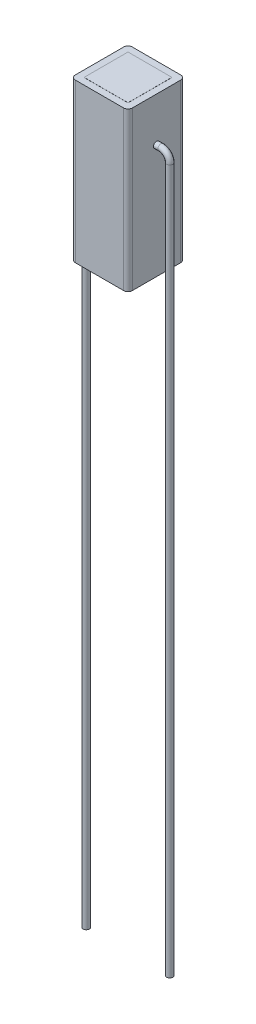
ISO-10303-21;
HEADER;
FILE_DESCRIPTION(('STEP AP214'),'2;1');
FILE_NAME('part.step','',(''),(''),'','','');
FILE_SCHEMA(('AUTOMOTIVE_DESIGN { 1 0 10303 214 1 1 1 1 }'));
ENDSEC;
DATA;
#1=APPLICATION_CONTEXT('core data for automotive mechanical design processes');
#2=APPLICATION_PROTOCOL_DEFINITION('international standard','automotive_design',2000,#1);
#3=PRODUCT_CONTEXT('',#1,'mechanical');
#4=PRODUCT('Part','Part','',(#3));
#5=PRODUCT_RELATED_PRODUCT_CATEGORY('part','',(#4));
#6=PRODUCT_DEFINITION_FORMATION('','',#4);
#7=PRODUCT_DEFINITION_CONTEXT('part definition',#1,'design');
#8=PRODUCT_DEFINITION('design','',#6,#7);
#9=PRODUCT_DEFINITION_SHAPE('','',#8);
#10=(LENGTH_UNIT() NAMED_UNIT(*) SI_UNIT(.MILLI.,.METRE.));
#11=(NAMED_UNIT(*) PLANE_ANGLE_UNIT() SI_UNIT($,.RADIAN.));
#12=(NAMED_UNIT(*) SI_UNIT($,.STERADIAN.) SOLID_ANGLE_UNIT());
#13=UNCERTAINTY_MEASURE_WITH_UNIT(LENGTH_MEASURE(1.E-05),#10,'distance_accuracy_value','');
#14=(GEOMETRIC_REPRESENTATION_CONTEXT(3) GLOBAL_UNCERTAINTY_ASSIGNED_CONTEXT((#13)) GLOBAL_UNIT_ASSIGNED_CONTEXT((#10,
#11,#12)) REPRESENTATION_CONTEXT('',''));
#15=CARTESIAN_POINT('',(0.,0.,0.));
#16=DIRECTION('',(0.,0.,1.));
#17=DIRECTION('',(1.,0.,0.));
#18=AXIS2_PLACEMENT_3D('',#15,#16,#17);
#19=CARTESIAN_POINT('',(3.25000000000001,18.,-3.25));
#20=DIRECTION('',(-1.,0.,0.));
#21=DIRECTION('',(0.,0.,1.));
#22=AXIS2_PLACEMENT_3D('',#19,#20,#21);
#23=PLANE('',#22);
#24=CARTESIAN_POINT('',(3.25000000000001,13.,0.));
#25=DIRECTION('',(-1.,0.,0.));
#26=DIRECTION('',(0.,0.,1.));
#27=AXIS2_PLACEMENT_3D('',#24,#25,#26);
#28=CIRCLE('',#27,0.35);
#29=CARTESIAN_POINT('',(3.25000000000001,13.,0.35));
#30=VERTEX_POINT('',#29);
#31=EDGE_CURVE('E293',#30,#30,#28,.F.);
#32=ORIENTED_EDGE('',*,*,#31,.F.);
#33=EDGE_LOOP('',(#32));
#34=FACE_BOUND('',#33,.T.);
#35=DIRECTION('',(0.,0.,-1.));
#36=VECTOR('',#35,1.);
#37=CARTESIAN_POINT('',(3.25000000000001,18.,-3.25));
#38=LINE('',#37,#36);
#39=CARTESIAN_POINT('',(3.25000000000001,18.,2.75000000000001));
#40=VERTEX_POINT('',#39);
#41=CARTESIAN_POINT('',(3.25000000000001,18.,-2.75));
#42=VERTEX_POINT('',#41);
#43=EDGE_CURVE('E261',#40,#42,#38,.T.);
#44=ORIENTED_EDGE('',*,*,#43,.F.);
#45=DIRECTION('',(0.,-1.,0.));
#46=VECTOR('',#45,1.);
#47=CARTESIAN_POINT('',(3.25000000000001,18.,2.75000000000001));
#48=LINE('',#47,#46);
#49=CARTESIAN_POINT('',(3.25000000000001,0.,2.75000000000001));
#50=VERTEX_POINT('',#49);
#51=EDGE_CURVE('E301',#40,#50,#48,.T.);
#52=ORIENTED_EDGE('',*,*,#51,.T.);
#53=DIRECTION('',(0.,0.,-1.));
#54=VECTOR('',#53,1.);
#55=CARTESIAN_POINT('',(3.25000000000001,0.,-3.25));
#56=LINE('',#55,#54);
#57=CARTESIAN_POINT('',(3.25000000000001,0.,-2.75));
#58=VERTEX_POINT('',#57);
#59=EDGE_CURVE('E260',#50,#58,#56,.T.);
#60=ORIENTED_EDGE('',*,*,#59,.T.);
#61=DIRECTION('',(0.,-1.,0.));
#62=VECTOR('',#61,1.);
#63=CARTESIAN_POINT('',(3.25000000000001,18.,-2.75));
#64=LINE('',#63,#62);
#65=EDGE_CURVE('E299',#58,#42,#64,.F.);
#66=ORIENTED_EDGE('',*,*,#65,.T.);
#67=EDGE_LOOP('',(#44,#52,#60,#66));
#68=FACE_BOUND('',#67,.T.);
#69=ADVANCED_FACE('F71',(#34,#68),#23,.F.);
#70=CARTESIAN_POINT('',(-3.24999999999999,18.,-3.25));
#71=DIRECTION('',(0.,0.,1.));
#72=DIRECTION('',(1.,0.,0.));
#73=AXIS2_PLACEMENT_3D('',#70,#71,#72);
#74=PLANE('',#73);
#75=DIRECTION('',(-1.,0.,0.));
#76=VECTOR('',#75,1.);
#77=CARTESIAN_POINT('',(-3.24999999999999,0.,-3.25));
#78=LINE('',#77,#76);
#79=CARTESIAN_POINT('',(2.75000000000001,0.,-3.25));
#80=VERTEX_POINT('',#79);
#81=CARTESIAN_POINT('',(-2.74999999999999,0.,-3.25));
#82=VERTEX_POINT('',#81);
#83=EDGE_CURVE('E275',#80,#82,#78,.T.);
#84=ORIENTED_EDGE('',*,*,#83,.T.);
#85=DIRECTION('',(0.,-1.,0.));
#86=VECTOR('',#85,1.);
#87=CARTESIAN_POINT('',(-2.74999999999999,18.,-3.25));
#88=LINE('',#87,#86);
#89=CARTESIAN_POINT('',(-2.74999999999999,18.,-3.25));
#90=VERTEX_POINT('',#89);
#91=EDGE_CURVE('E14',#82,#90,#88,.F.);
#92=ORIENTED_EDGE('',*,*,#91,.T.);
#93=DIRECTION('',(-1.,0.,0.));
#94=VECTOR('',#93,1.);
#95=CARTESIAN_POINT('',(-3.24999999999999,18.,-3.25));
#96=LINE('',#95,#94);
#97=CARTESIAN_POINT('',(2.75000000000001,18.,-3.25));
#98=VERTEX_POINT('',#97);
#99=EDGE_CURVE('E264',#98,#90,#96,.T.);
#100=ORIENTED_EDGE('',*,*,#99,.F.);
#101=DIRECTION('',(0.,-1.,0.));
#102=VECTOR('',#101,1.);
#103=CARTESIAN_POINT('',(2.75000000000001,18.,-3.25));
#104=LINE('',#103,#102);
#105=EDGE_CURVE('E79',#98,#80,#104,.T.);
#106=ORIENTED_EDGE('',*,*,#105,.T.);
#107=EDGE_LOOP('',(#84,#92,#100,#106));
#108=FACE_BOUND('',#107,.T.);
#109=ADVANCED_FACE('F332',(#108),#74,.F.);
#110=CARTESIAN_POINT('',(-3.24999999999999,18.,-3.25));
#111=DIRECTION('',(1.,0.,0.));
#112=DIRECTION('',(0.,0.,-1.));
#113=AXIS2_PLACEMENT_3D('',#110,#111,#112);
#114=PLANE('',#113);
#115=CARTESIAN_POINT('',(-3.24999999999999,13.,0.));
#116=DIRECTION('',(1.,0.,0.));
#117=DIRECTION('',(0.,0.,-1.));
#118=AXIS2_PLACEMENT_3D('',#115,#116,#117);
#119=CIRCLE('',#118,0.35);
#120=CARTESIAN_POINT('',(-3.24999999999999,13.,-0.35));
#121=VERTEX_POINT('',#120);
#122=EDGE_CURVE('E296',#121,#121,#119,.F.);
#123=ORIENTED_EDGE('',*,*,#122,.F.);
#124=EDGE_LOOP('',(#123));
#125=FACE_BOUND('',#124,.T.);
#126=DIRECTION('',(0.,0.,1.));
#127=VECTOR('',#126,1.);
#128=CARTESIAN_POINT('',(-3.24999999999999,0.,-3.25));
#129=LINE('',#128,#127);
#130=CARTESIAN_POINT('',(-3.24999999999999,0.,-2.75));
#131=VERTEX_POINT('',#130);
#132=CARTESIAN_POINT('',(-3.24999999999999,0.,2.75000000000001));
#133=VERTEX_POINT('',#132);
#134=EDGE_CURVE('E278',#131,#133,#129,.T.);
#135=ORIENTED_EDGE('',*,*,#134,.T.);
#136=DIRECTION('',(0.,-1.,0.));
#137=VECTOR('',#136,1.);
#138=CARTESIAN_POINT('',(-3.24999999999999,18.,2.75000000000001));
#139=LINE('',#138,#137);
#140=CARTESIAN_POINT('',(-3.24999999999999,18.,2.75000000000001));
#141=VERTEX_POINT('',#140);
#142=EDGE_CURVE('E86',#133,#141,#139,.F.);
#143=ORIENTED_EDGE('',*,*,#142,.T.);
#144=DIRECTION('',(0.,0.,1.));
#145=VECTOR('',#144,1.);
#146=CARTESIAN_POINT('',(-3.24999999999999,18.,-3.25));
#147=LINE('',#146,#145);
#148=CARTESIAN_POINT('',(-3.24999999999999,18.,-2.75));
#149=VERTEX_POINT('',#148);
#150=EDGE_CURVE('E267',#149,#141,#147,.T.);
#151=ORIENTED_EDGE('',*,*,#150,.F.);
#152=DIRECTION('',(0.,-1.,0.));
#153=VECTOR('',#152,1.);
#154=CARTESIAN_POINT('',(-3.24999999999999,18.,-2.75));
#155=LINE('',#154,#153);
#156=EDGE_CURVE('E324',#149,#131,#155,.T.);
#157=ORIENTED_EDGE('',*,*,#156,.T.);
#158=EDGE_LOOP('',(#135,#143,#151,#157));
#159=FACE_BOUND('',#158,.T.);
#160=ADVANCED_FACE('F343',(#125,#159),#114,.F.);
#161=CARTESIAN_POINT('',(-3.24999999999999,18.,3.25000000000001));
#162=DIRECTION('',(0.,0.,-1.));
#163=DIRECTION('',(-1.,0.,0.));
#164=AXIS2_PLACEMENT_3D('',#161,#162,#163);
#165=PLANE('',#164);
#166=DIRECTION('',(1.,0.,0.));
#167=VECTOR('',#166,1.);
#168=CARTESIAN_POINT('',(-3.24999999999999,0.,3.25000000000001));
#169=LINE('',#168,#167);
#170=CARTESIAN_POINT('',(-2.74999999999999,0.,3.25000000000001));
#171=VERTEX_POINT('',#170);
#172=CARTESIAN_POINT('',(2.75000000000001,0.,3.25000000000001));
#173=VERTEX_POINT('',#172);
#174=EDGE_CURVE('E265',#171,#173,#169,.T.);
#175=ORIENTED_EDGE('',*,*,#174,.T.);
#176=DIRECTION('',(0.,-1.,0.));
#177=VECTOR('',#176,1.);
#178=CARTESIAN_POINT('',(2.75000000000001,18.,3.25000000000001));
#179=LINE('',#178,#177);
#180=CARTESIAN_POINT('',(2.75000000000001,18.,3.25000000000001));
#181=VERTEX_POINT('',#180);
#182=EDGE_CURVE('E315',#173,#181,#179,.F.);
#183=ORIENTED_EDGE('',*,*,#182,.T.);
#184=DIRECTION('',(1.,0.,0.));
#185=VECTOR('',#184,1.);
#186=CARTESIAN_POINT('',(-3.24999999999999,18.,3.25000000000001));
#187=LINE('',#186,#185);
#188=CARTESIAN_POINT('',(-2.74999999999999,18.,3.25000000000001));
#189=VERTEX_POINT('',#188);
#190=EDGE_CURVE('E269',#189,#181,#187,.T.);
#191=ORIENTED_EDGE('',*,*,#190,.F.);
#192=DIRECTION('',(0.,-1.,0.));
#193=VECTOR('',#192,1.);
#194=CARTESIAN_POINT('',(-2.74999999999999,18.,3.25000000000001));
#195=LINE('',#194,#193);
#196=EDGE_CURVE('E312',#189,#171,#195,.T.);
#197=ORIENTED_EDGE('',*,*,#196,.T.);
#198=EDGE_LOOP('',(#175,#183,#191,#197));
#199=FACE_BOUND('',#198,.T.);
#200=ADVANCED_FACE('F352',(#199),#165,.F.);
#201=CARTESIAN_POINT('',(0.,18.,0.));
#202=DIRECTION('',(0.,1.,0.));
#203=DIRECTION('',(0.,0.,1.));
#204=AXIS2_PLACEMENT_3D('',#201,#202,#203);
#205=PLANE('',#204);
#206=DIRECTION('',(0.,0.,-1.));
#207=VECTOR('',#206,1.);
#208=CARTESIAN_POINT('',(2.5,18.,0.));
#209=LINE('',#208,#207);
#210=CARTESIAN_POINT('',(2.5,18.,2.5));
#211=VERTEX_POINT('',#210);
#212=CARTESIAN_POINT('',(2.5,18.,-2.5));
#213=VERTEX_POINT('',#212);
#214=EDGE_CURVE('E257',#211,#213,#209,.T.);
#215=ORIENTED_EDGE('',*,*,#214,.F.);
#216=DIRECTION('',(1.,0.,0.));
#217=VECTOR('',#216,1.);
#218=CARTESIAN_POINT('',(0.,18.,2.5));
#219=LINE('',#218,#217);
#220=CARTESIAN_POINT('',(-2.5,18.,2.5));
#221=VERTEX_POINT('',#220);
#222=EDGE_CURVE('E254',#221,#211,#219,.T.);
#223=ORIENTED_EDGE('',*,*,#222,.F.);
#224=DIRECTION('',(0.,0.,1.));
#225=VECTOR('',#224,1.);
#226=CARTESIAN_POINT('',(-2.5,18.,0.));
#227=LINE('',#226,#225);
#228=CARTESIAN_POINT('',(-2.5,18.,-2.5));
#229=VERTEX_POINT('',#228);
#230=EDGE_CURVE('E251',#229,#221,#227,.T.);
#231=ORIENTED_EDGE('',*,*,#230,.F.);
#232=DIRECTION('',(-1.,0.,0.));
#233=VECTOR('',#232,1.);
#234=CARTESIAN_POINT('',(0.,18.,-2.5));
#235=LINE('',#234,#233);
#236=EDGE_CURVE('E237',#213,#229,#235,.T.);
#237=ORIENTED_EDGE('',*,*,#236,.F.);
#238=EDGE_LOOP('',(#215,#223,#231,#237));
#239=FACE_BOUND('',#238,.T.);
#240=ORIENTED_EDGE('',*,*,#190,.T.);
#241=CARTESIAN_POINT('',(2.75000000000001,18.,2.75000000000001));
#242=DIRECTION('',(0.,1.,0.));
#243=DIRECTION('',(0.,0.,1.));
#244=AXIS2_PLACEMENT_3D('',#241,#242,#243);
#245=CIRCLE('',#244,0.5);
#246=EDGE_CURVE('E322',#181,#40,#245,.T.);
#247=ORIENTED_EDGE('',*,*,#246,.T.);
#248=ORIENTED_EDGE('',*,*,#43,.T.);
#249=CARTESIAN_POINT('',(2.75000000000001,18.,-2.75));
#250=DIRECTION('',(0.,1.,0.));
#251=DIRECTION('',(0.,0.,1.));
#252=AXIS2_PLACEMENT_3D('',#249,#250,#251);
#253=CIRCLE('',#252,0.5);
#254=EDGE_CURVE('E317',#42,#98,#253,.T.);
#255=ORIENTED_EDGE('',*,*,#254,.T.);
#256=ORIENTED_EDGE('',*,*,#99,.T.);
#257=CARTESIAN_POINT('',(-2.74999999999999,18.,-2.75));
#258=DIRECTION('',(0.,1.,0.));
#259=DIRECTION('',(0.,0.,1.));
#260=AXIS2_PLACEMENT_3D('',#257,#258,#259);
#261=CIRCLE('',#260,0.5);
#262=EDGE_CURVE('E93',#90,#149,#261,.T.);
#263=ORIENTED_EDGE('',*,*,#262,.T.);
#264=ORIENTED_EDGE('',*,*,#150,.T.);
#265=CARTESIAN_POINT('',(-2.74999999999999,18.,2.75000000000001));
#266=DIRECTION('',(0.,1.,0.));
#267=DIRECTION('',(0.,0.,1.));
#268=AXIS2_PLACEMENT_3D('',#265,#266,#267);
#269=CIRCLE('',#268,0.5);
#270=EDGE_CURVE('E320',#141,#189,#269,.T.);
#271=ORIENTED_EDGE('',*,*,#270,.T.);
#272=EDGE_LOOP('',(#240,#247,#248,#255,#256,#263,#264,#271));
#273=FACE_BOUND('',#272,.T.);
#274=ADVANCED_FACE('F345',(#239,#273),#205,.T.);
#275=CARTESIAN_POINT('',(0.,0.,0.));
#276=DIRECTION('',(0.,1.,0.));
#277=DIRECTION('',(0.,0.,1.));
#278=AXIS2_PLACEMENT_3D('',#275,#276,#277);
#279=PLANE('',#278);
#280=DIRECTION('',(1.,0.,0.));
#281=VECTOR('',#280,1.);
#282=CARTESIAN_POINT('',(0.,0.,2.5));
#283=LINE('',#282,#281);
#284=CARTESIAN_POINT('',(-2.5,0.,2.5));
#285=VERTEX_POINT('',#284);
#286=CARTESIAN_POINT('',(2.5,0.,2.5));
#287=VERTEX_POINT('',#286);
#288=EDGE_CURVE('E287',#285,#287,#283,.T.);
#289=ORIENTED_EDGE('',*,*,#288,.T.);
#290=DIRECTION('',(0.,0.,-1.));
#291=VECTOR('',#290,1.);
#292=CARTESIAN_POINT('',(2.5,0.,0.));
#293=LINE('',#292,#291);
#294=CARTESIAN_POINT('',(2.5,0.,-2.5));
#295=VERTEX_POINT('',#294);
#296=EDGE_CURVE('E290',#287,#295,#293,.T.);
#297=ORIENTED_EDGE('',*,*,#296,.T.);
#298=DIRECTION('',(-1.,0.,0.));
#299=VECTOR('',#298,1.);
#300=CARTESIAN_POINT('',(0.,0.,-2.5));
#301=LINE('',#300,#299);
#302=CARTESIAN_POINT('',(-2.5,0.,-2.5));
#303=VERTEX_POINT('',#302);
#304=EDGE_CURVE('E272',#295,#303,#301,.T.);
#305=ORIENTED_EDGE('',*,*,#304,.T.);
#306=DIRECTION('',(0.,0.,1.));
#307=VECTOR('',#306,1.);
#308=CARTESIAN_POINT('',(-2.5,0.,0.));
#309=LINE('',#308,#307);
#310=EDGE_CURVE('E284',#303,#285,#309,.T.);
#311=ORIENTED_EDGE('',*,*,#310,.T.);
#312=EDGE_LOOP('',(#289,#297,#305,#311));
#313=FACE_BOUND('',#312,.T.);
#314=ORIENTED_EDGE('',*,*,#59,.F.);
#315=CARTESIAN_POINT('',(2.75000000000001,0.,2.75000000000001));
#316=DIRECTION('',(0.,1.,0.));
#317=DIRECTION('',(0.,0.,1.));
#318=AXIS2_PLACEMENT_3D('',#315,#316,#317);
#319=CIRCLE('',#318,0.5);
#320=EDGE_CURVE('E310',#50,#173,#319,.F.);
#321=ORIENTED_EDGE('',*,*,#320,.T.);
#322=ORIENTED_EDGE('',*,*,#174,.F.);
#323=CARTESIAN_POINT('',(-2.74999999999999,0.,2.75000000000001));
#324=DIRECTION('',(0.,1.,0.));
#325=DIRECTION('',(0.,0.,1.));
#326=AXIS2_PLACEMENT_3D('',#323,#324,#325);
#327=CIRCLE('',#326,0.5);
#328=EDGE_CURVE('E308',#171,#133,#327,.F.);
#329=ORIENTED_EDGE('',*,*,#328,.T.);
#330=ORIENTED_EDGE('',*,*,#134,.F.);
#331=CARTESIAN_POINT('',(-2.74999999999999,0.,-2.75));
#332=DIRECTION('',(0.,1.,0.));
#333=DIRECTION('',(0.,0.,1.));
#334=AXIS2_PLACEMENT_3D('',#331,#332,#333);
#335=CIRCLE('',#334,0.5);
#336=EDGE_CURVE('E306',#131,#82,#335,.F.);
#337=ORIENTED_EDGE('',*,*,#336,.T.);
#338=ORIENTED_EDGE('',*,*,#83,.F.);
#339=CARTESIAN_POINT('',(2.75000000000001,0.,-2.75));
#340=DIRECTION('',(0.,1.,0.));
#341=DIRECTION('',(0.,0.,1.));
#342=AXIS2_PLACEMENT_3D('',#339,#340,#341);
#343=CIRCLE('',#342,0.5);
#344=EDGE_CURVE('E304',#80,#58,#343,.F.);
#345=ORIENTED_EDGE('',*,*,#344,.T.);
#346=EDGE_LOOP('',(#314,#321,#322,#329,#330,#337,#338,#345));
#347=FACE_BOUND('',#346,.T.);
#348=ADVANCED_FACE('F338',(#313,#347),#279,.F.);
#349=CARTESIAN_POINT('',(0.,-0.01,0.));
#350=DIRECTION('',(0.,1.,0.));
#351=DIRECTION('',(0.,0.,1.));
#352=AXIS2_PLACEMENT_3D('',#349,#350,#351);
#353=PLANE('',#352);
#354=DIRECTION('',(0.,0.,-1.));
#355=VECTOR('',#354,1.);
#356=CARTESIAN_POINT('',(2.5,-0.01,-2.5));
#357=LINE('',#356,#355);
#358=CARTESIAN_POINT('',(2.5,-0.01,2.5));
#359=VERTEX_POINT('',#358);
#360=CARTESIAN_POINT('',(2.5,-0.01,-2.5));
#361=VERTEX_POINT('',#360);
#362=EDGE_CURVE('E221',#359,#361,#357,.T.);
#363=ORIENTED_EDGE('',*,*,#362,.F.);
#364=DIRECTION('',(1.,0.,0.));
#365=VECTOR('',#364,1.);
#366=CARTESIAN_POINT('',(-2.5,-0.01,2.5));
#367=LINE('',#366,#365);
#368=CARTESIAN_POINT('',(-2.5,-0.01,2.5));
#369=VERTEX_POINT('',#368);
#370=EDGE_CURVE('E230',#369,#359,#367,.T.);
#371=ORIENTED_EDGE('',*,*,#370,.F.);
#372=DIRECTION('',(0.,0.,1.));
#373=VECTOR('',#372,1.);
#374=CARTESIAN_POINT('',(-2.5,-0.01,-2.5));
#375=LINE('',#374,#373);
#376=CARTESIAN_POINT('',(-2.5,-0.01,-2.5));
#377=VERTEX_POINT('',#376);
#378=EDGE_CURVE('E227',#377,#369,#375,.T.);
#379=ORIENTED_EDGE('',*,*,#378,.F.);
#380=DIRECTION('',(-1.,0.,0.));
#381=VECTOR('',#380,1.);
#382=CARTESIAN_POINT('',(-2.5,-0.01,-2.5));
#383=LINE('',#382,#381);
#384=EDGE_CURVE('E224',#361,#377,#383,.T.);
#385=ORIENTED_EDGE('',*,*,#384,.F.);
#386=EDGE_LOOP('',(#363,#371,#379,#385));
#387=FACE_BOUND('',#386,.T.);
#388=ADVANCED_FACE('F553',(#387),#353,.F.);
#389=CARTESIAN_POINT('',(-2.5,-0.01,-2.5));
#390=DIRECTION('',(0.,0.,-1.));
#391=DIRECTION('',(-1.,0.,0.));
#392=AXIS2_PLACEMENT_3D('',#389,#390,#391);
#393=PLANE('',#392);
#394=ORIENTED_EDGE('',*,*,#304,.F.);
#395=DIRECTION('',(0.,1.,0.));
#396=VECTOR('',#395,1.);
#397=CARTESIAN_POINT('',(2.5,-0.01,-2.5));
#398=LINE('',#397,#396);
#399=EDGE_CURVE('E246',#361,#295,#398,.T.);
#400=ORIENTED_EDGE('',*,*,#399,.F.);
#401=ORIENTED_EDGE('',*,*,#384,.T.);
#402=DIRECTION('',(0.,1.,0.));
#403=VECTOR('',#402,1.);
#404=CARTESIAN_POINT('',(-2.5,-0.01,-2.5));
#405=LINE('',#404,#403);
#406=EDGE_CURVE('E243',#377,#303,#405,.T.);
#407=ORIENTED_EDGE('',*,*,#406,.T.);
#408=EDGE_LOOP('',(#394,#400,#401,#407));
#409=FACE_BOUND('',#408,.T.);
#410=ADVANCED_FACE('F496',(#409),#393,.T.);
#411=CARTESIAN_POINT('',(-2.5,-0.01,-2.5));
#412=DIRECTION('',(-1.,0.,0.));
#413=DIRECTION('',(0.,0.,1.));
#414=AXIS2_PLACEMENT_3D('',#411,#412,#413);
#415=PLANE('',#414);
#416=ORIENTED_EDGE('',*,*,#310,.F.);
#417=ORIENTED_EDGE('',*,*,#406,.F.);
#418=ORIENTED_EDGE('',*,*,#378,.T.);
#419=DIRECTION('',(0.,1.,0.));
#420=VECTOR('',#419,1.);
#421=CARTESIAN_POINT('',(-2.5,-0.01,2.5));
#422=LINE('',#421,#420);
#423=EDGE_CURVE('E239',#369,#285,#422,.T.);
#424=ORIENTED_EDGE('',*,*,#423,.T.);
#425=EDGE_LOOP('',(#416,#417,#418,#424));
#426=FACE_BOUND('',#425,.T.);
#427=ADVANCED_FACE('F506',(#426),#415,.T.);
#428=CARTESIAN_POINT('',(-2.5,-0.01,2.5));
#429=DIRECTION('',(0.,0.,1.));
#430=DIRECTION('',(1.,0.,0.));
#431=AXIS2_PLACEMENT_3D('',#428,#429,#430);
#432=PLANE('',#431);
#433=ORIENTED_EDGE('',*,*,#288,.F.);
#434=ORIENTED_EDGE('',*,*,#423,.F.);
#435=ORIENTED_EDGE('',*,*,#370,.T.);
#436=DIRECTION('',(0.,1.,0.));
#437=VECTOR('',#436,1.);
#438=CARTESIAN_POINT('',(2.5,-0.01,2.5));
#439=LINE('',#438,#437);
#440=EDGE_CURVE('E234',#359,#287,#439,.T.);
#441=ORIENTED_EDGE('',*,*,#440,.T.);
#442=EDGE_LOOP('',(#433,#434,#435,#441));
#443=FACE_BOUND('',#442,.T.);
#444=ADVANCED_FACE('F516',(#443),#432,.T.);
#445=CARTESIAN_POINT('',(2.5,-0.01,-2.5));
#446=DIRECTION('',(1.,0.,0.));
#447=DIRECTION('',(0.,0.,-1.));
#448=AXIS2_PLACEMENT_3D('',#445,#446,#447);
#449=PLANE('',#448);
#450=ORIENTED_EDGE('',*,*,#296,.F.);
#451=ORIENTED_EDGE('',*,*,#440,.F.);
#452=ORIENTED_EDGE('',*,*,#362,.T.);
#453=ORIENTED_EDGE('',*,*,#399,.T.);
#454=EDGE_LOOP('',(#450,#451,#452,#453));
#455=FACE_BOUND('',#454,.T.);
#456=ADVANCED_FACE('F523',(#455),#449,.T.);
#457=CARTESIAN_POINT('',(2.5,18.01,2.5));
#458=VERTEX_POINT('',#457);
#459=EDGE_CURVE('E238',#211,#458,#439,.T.);
#460=ORIENTED_EDGE('',*,*,#459,.F.);
#461=ORIENTED_EDGE('',*,*,#214,.T.);
#462=CARTESIAN_POINT('',(2.5,18.01,-2.5));
#463=VERTEX_POINT('',#462);
#464=EDGE_CURVE('E233',#213,#463,#398,.T.);
#465=ORIENTED_EDGE('',*,*,#464,.T.);
#466=DIRECTION('',(0.,0.,-1.));
#467=VECTOR('',#466,1.);
#468=CARTESIAN_POINT('',(2.5,18.01,-2.5));
#469=LINE('',#468,#467);
#470=EDGE_CURVE('E209',#458,#463,#469,.T.);
#471=ORIENTED_EDGE('',*,*,#470,.F.);
#472=EDGE_LOOP('',(#460,#461,#465,#471));
#473=FACE_BOUND('',#472,.T.);
#474=ADVANCED_FACE('F513',(#473),#449,.T.);
#475=CARTESIAN_POINT('',(-2.5,18.01,2.5));
#476=VERTEX_POINT('',#475);
#477=EDGE_CURVE('E242',#221,#476,#422,.T.);
#478=ORIENTED_EDGE('',*,*,#477,.F.);
#479=ORIENTED_EDGE('',*,*,#222,.T.);
#480=ORIENTED_EDGE('',*,*,#459,.T.);
#481=DIRECTION('',(1.,0.,0.));
#482=VECTOR('',#481,1.);
#483=CARTESIAN_POINT('',(-2.5,18.01,2.5));
#484=LINE('',#483,#482);
#485=EDGE_CURVE('E218',#476,#458,#484,.T.);
#486=ORIENTED_EDGE('',*,*,#485,.F.);
#487=EDGE_LOOP('',(#478,#479,#480,#486));
#488=FACE_BOUND('',#487,.T.);
#489=ADVANCED_FACE('F503',(#488),#432,.T.);
#490=CARTESIAN_POINT('',(-2.5,18.01,-2.5));
#491=VERTEX_POINT('',#490);
#492=EDGE_CURVE('E245',#229,#491,#405,.T.);
#493=ORIENTED_EDGE('',*,*,#492,.F.);
#494=ORIENTED_EDGE('',*,*,#230,.T.);
#495=ORIENTED_EDGE('',*,*,#477,.T.);
#496=DIRECTION('',(0.,0.,1.));
#497=VECTOR('',#496,1.);
#498=CARTESIAN_POINT('',(-2.5,18.01,-2.5));
#499=LINE('',#498,#497);
#500=EDGE_CURVE('E215',#491,#476,#499,.T.);
#501=ORIENTED_EDGE('',*,*,#500,.F.);
#502=EDGE_LOOP('',(#493,#494,#495,#501));
#503=FACE_BOUND('',#502,.T.);
#504=ADVANCED_FACE('F493',(#503),#415,.T.);
#505=ORIENTED_EDGE('',*,*,#464,.F.);
#506=ORIENTED_EDGE('',*,*,#236,.T.);
#507=ORIENTED_EDGE('',*,*,#492,.T.);
#508=DIRECTION('',(-1.,0.,0.));
#509=VECTOR('',#508,1.);
#510=CARTESIAN_POINT('',(-2.5,18.01,-2.5));
#511=LINE('',#510,#509);
#512=EDGE_CURVE('E212',#463,#491,#511,.T.);
#513=ORIENTED_EDGE('',*,*,#512,.F.);
#514=EDGE_LOOP('',(#505,#506,#507,#513));
#515=FACE_BOUND('',#514,.T.);
#516=ADVANCED_FACE('F483',(#515),#393,.T.);
#517=CARTESIAN_POINT('',(0.,18.01,0.));
#518=DIRECTION('',(0.,1.,0.));
#519=DIRECTION('',(0.,0.,1.));
#520=AXIS2_PLACEMENT_3D('',#517,#518,#519);
#521=PLANE('',#520);
#522=ORIENTED_EDGE('',*,*,#470,.T.);
#523=ORIENTED_EDGE('',*,*,#512,.T.);
#524=ORIENTED_EDGE('',*,*,#500,.T.);
#525=ORIENTED_EDGE('',*,*,#485,.T.);
#526=EDGE_LOOP('',(#522,#523,#524,#525));
#527=FACE_BOUND('',#526,.T.);
#528=ADVANCED_FACE('F448',(#527),#521,.T.);
#529=CARTESIAN_POINT('',(4.75000000000002,-68.1171032671054,0.));
#530=DIRECTION('',(0.,1.,0.));
#531=DIRECTION('',(-1.,0.,0.));
#532=AXIS2_PLACEMENT_3D('',#529,#530,#531);
#533=PLANE('',#532);
#534=CARTESIAN_POINT('',(4.75000000000002,-68.1171032671054,0.));
#535=DIRECTION('',(0.,1.,0.));
#536=DIRECTION('',(-1.,0.,0.));
#537=AXIS2_PLACEMENT_3D('',#534,#535,#536);
#538=CIRCLE('',#537,0.35);
#539=CARTESIAN_POINT('',(4.40000000000002,-68.1171032671054,0.));
#540=VERTEX_POINT('',#539);
#541=EDGE_CURVE('E207',#540,#540,#538,.T.);
#542=ORIENTED_EDGE('',*,*,#541,.F.);
#543=EDGE_LOOP('',(#542));
#544=FACE_BOUND('',#543,.T.);
#545=ADVANCED_FACE('F410',(#544),#533,.F.);
#546=CARTESIAN_POINT('',(3.25000000000002,13.,0.));
#547=DIRECTION('',(1.,0.,0.));
#548=DIRECTION('',(0.,0.,-1.));
#549=AXIS2_PLACEMENT_3D('',#546,#547,#548);
#550=CYLINDRICAL_SURFACE('',#549,0.35);
#551=CARTESIAN_POINT('',(3.75000000000002,13.,0.));
#552=DIRECTION('',(-1.,0.,0.));
#553=DIRECTION('',(0.,-1.,0.));
#554=AXIS2_PLACEMENT_3D('',#551,#552,#553);
#555=CIRCLE('',#554,0.35);
#556=CARTESIAN_POINT('',(3.75000000000002,13.35,0.));
#557=VERTEX_POINT('',#556);
#558=EDGE_CURVE('E194',#557,#557,#555,.T.);
#559=ORIENTED_EDGE('',*,*,#558,.T.);
#560=EDGE_LOOP('',(#559));
#561=FACE_BOUND('',#560,.T.);
#562=ORIENTED_EDGE('',*,*,#31,.T.);
#563=EDGE_LOOP('',(#562));
#564=FACE_BOUND('',#563,.T.);
#565=ADVANCED_FACE('F456',(#561,#564),#550,.T.);
#566=CARTESIAN_POINT('',(3.75000000000001,12.,0.));
#567=DIRECTION('',(0.,0.,-1.));
#568=DIRECTION('',(-1.,0.,0.));
#569=AXIS2_PLACEMENT_3D('',#566,#567,#568);
#570=TOROIDAL_SURFACE('',#569,1.,0.35);
#571=CARTESIAN_POINT('',(4.75000000000002,12.,0.));
#572=DIRECTION('',(0.,1.,0.));
#573=DIRECTION('',(-1.,0.,0.));
#574=AXIS2_PLACEMENT_3D('',#571,#572,#573);
#575=CIRCLE('',#574,0.35);
#576=CARTESIAN_POINT('',(5.10000000000001,12.,0.));
#577=VERTEX_POINT('',#576);
#578=EDGE_CURVE('E198',#577,#577,#575,.T.);
#579=CARTESIAN_POINT('',(3.75000000000001,12.,0.));
#580=DIRECTION('',(0.,0.,-1.));
#581=DIRECTION('',(-1.,0.,0.));
#582=AXIS2_PLACEMENT_3D('',#579,#580,#581);
#583=CIRCLE('',#582,1.35);
#584=EDGE_CURVE('',#557,#577,#583,.T.);
#585=ORIENTED_EDGE('',*,*,#558,.F.);
#586=ORIENTED_EDGE('',*,*,#578,.T.);
#587=ORIENTED_EDGE('',*,*,#584,.T.);
#588=ORIENTED_EDGE('',*,*,#584,.F.);
#589=EDGE_LOOP('',(#585,#587,#586,#588));
#590=FACE_BOUND('',#589,.T.);
#591=ADVANCED_FACE('F445',(#590),#570,.T.);
#592=CARTESIAN_POINT('',(4.75000000000001,12.,0.));
#593=DIRECTION('',(0.,-1.,0.));
#594=DIRECTION('',(1.,0.,0.));
#595=AXIS2_PLACEMENT_3D('',#592,#593,#594);
#596=CYLINDRICAL_SURFACE('',#595,0.35);
#597=ORIENTED_EDGE('',*,*,#541,.T.);
#598=EDGE_LOOP('',(#597));
#599=FACE_BOUND('',#598,.T.);
#600=ORIENTED_EDGE('',*,*,#578,.F.);
#601=EDGE_LOOP('',(#600));
#602=FACE_BOUND('',#601,.T.);
#603=ADVANCED_FACE('F437',(#599,#602),#596,.T.);
#604=CARTESIAN_POINT('',(-4.75000000000002,-68.1171032671054,0.));
#605=DIRECTION('',(0.,1.,0.));
#606=DIRECTION('',(1.,0.,0.));
#607=AXIS2_PLACEMENT_3D('',#604,#605,#606);
#608=PLANE('',#607);
#609=CARTESIAN_POINT('',(-4.75000000000002,-68.1171032671054,0.));
#610=DIRECTION('',(0.,-1.,0.));
#611=DIRECTION('',(1.,0.,0.));
#612=AXIS2_PLACEMENT_3D('',#609,#610,#611);
#613=CIRCLE('',#612,0.35);
#614=CARTESIAN_POINT('',(-4.40000000000002,-68.1171032671054,0.));
#615=VERTEX_POINT('',#614);
#616=EDGE_CURVE('E190',#615,#615,#613,.F.);
#617=ORIENTED_EDGE('',*,*,#616,.F.);
#618=EDGE_LOOP('',(#617));
#619=FACE_BOUND('',#618,.T.);
#620=ADVANCED_FACE('F377',(#619),#608,.F.);
#621=CARTESIAN_POINT('',(-3.25000000000002,13.,0.));
#622=DIRECTION('',(-1.,0.,0.));
#623=DIRECTION('',(0.,0.,1.));
#624=AXIS2_PLACEMENT_3D('',#621,#622,#623);
#625=CYLINDRICAL_SURFACE('',#624,0.35);
#626=CARTESIAN_POINT('',(-3.75000000000002,13.,0.));
#627=DIRECTION('',(-1.,0.,0.));
#628=DIRECTION('',(0.,-1.,0.));
#629=AXIS2_PLACEMENT_3D('',#626,#627,#628);
#630=CIRCLE('',#629,0.35);
#631=CARTESIAN_POINT('',(-3.75000000000002,13.35,0.));
#632=VERTEX_POINT('',#631);
#633=EDGE_CURVE('E201',#632,#632,#630,.F.);
#634=ORIENTED_EDGE('',*,*,#633,.T.);
#635=EDGE_LOOP('',(#634));
#636=FACE_BOUND('',#635,.T.);
#637=ORIENTED_EDGE('',*,*,#122,.T.);
#638=EDGE_LOOP('',(#637));
#639=FACE_BOUND('',#638,.T.);
#640=ADVANCED_FACE('F418',(#636,#639),#625,.T.);
#641=CARTESIAN_POINT('',(-3.75000000000001,12.,0.));
#642=DIRECTION('',(0.,0.,1.));
#643=DIRECTION('',(1.,0.,0.));
#644=AXIS2_PLACEMENT_3D('',#641,#642,#643);
#645=TOROIDAL_SURFACE('',#644,1.,0.35);
#646=CARTESIAN_POINT('',(-4.75000000000002,12.,0.));
#647=DIRECTION('',(0.,-1.,0.));
#648=DIRECTION('',(1.,0.,0.));
#649=AXIS2_PLACEMENT_3D('',#646,#647,#648);
#650=CIRCLE('',#649,0.35);
#651=CARTESIAN_POINT('',(-5.10000000000001,12.,0.));
#652=VERTEX_POINT('',#651);
#653=EDGE_CURVE('E195',#652,#652,#650,.F.);
#654=CARTESIAN_POINT('',(-3.75000000000001,12.,0.));
#655=DIRECTION('',(0.,0.,1.));
#656=DIRECTION('',(1.,0.,0.));
#657=AXIS2_PLACEMENT_3D('',#654,#655,#656);
#658=CIRCLE('',#657,1.35);
#659=EDGE_CURVE('',#632,#652,#658,.T.);
#660=ORIENTED_EDGE('',*,*,#633,.F.);
#661=ORIENTED_EDGE('',*,*,#653,.T.);
#662=ORIENTED_EDGE('',*,*,#659,.T.);
#663=ORIENTED_EDGE('',*,*,#659,.F.);
#664=EDGE_LOOP('',(#660,#662,#661,#663));
#665=FACE_BOUND('',#664,.T.);
#666=ADVANCED_FACE('F408',(#665),#645,.T.);
#667=CARTESIAN_POINT('',(-4.75000000000001,12.,0.));
#668=DIRECTION('',(0.,-1.,0.));
#669=DIRECTION('',(1.,0.,0.));
#670=AXIS2_PLACEMENT_3D('',#667,#668,#669);
#671=CYLINDRICAL_SURFACE('',#670,0.35);
#672=ORIENTED_EDGE('',*,*,#616,.T.);
#673=EDGE_LOOP('',(#672));
#674=FACE_BOUND('',#673,.T.);
#675=ORIENTED_EDGE('',*,*,#653,.F.);
#676=EDGE_LOOP('',(#675));
#677=FACE_BOUND('',#676,.T.);
#678=ADVANCED_FACE('F191',(#674,#677),#671,.T.);
#679=CARTESIAN_POINT('',(2.75000000000001,18.,2.75000000000001));
#680=DIRECTION('',(0.,-1.,0.));
#681=DIRECTION('',(0.,0.,-1.));
#682=AXIS2_PLACEMENT_3D('',#679,#680,#681);
#683=CYLINDRICAL_SURFACE('',#682,0.5);
#684=ORIENTED_EDGE('',*,*,#246,.F.);
#685=ORIENTED_EDGE('',*,*,#182,.F.);
#686=ORIENTED_EDGE('',*,*,#320,.F.);
#687=ORIENTED_EDGE('',*,*,#51,.F.);
#688=EDGE_LOOP('',(#684,#685,#686,#687));
#689=FACE_BOUND('',#688,.T.);
#690=ADVANCED_FACE('F357',(#689),#683,.T.);
#691=CARTESIAN_POINT('',(-2.74999999999999,18.,2.75000000000001));
#692=DIRECTION('',(0.,-1.,0.));
#693=DIRECTION('',(0.,0.,-1.));
#694=AXIS2_PLACEMENT_3D('',#691,#692,#693);
#695=CYLINDRICAL_SURFACE('',#694,0.5);
#696=ORIENTED_EDGE('',*,*,#270,.F.);
#697=ORIENTED_EDGE('',*,*,#142,.F.);
#698=ORIENTED_EDGE('',*,*,#328,.F.);
#699=ORIENTED_EDGE('',*,*,#196,.F.);
#700=EDGE_LOOP('',(#696,#697,#698,#699));
#701=FACE_BOUND('',#700,.T.);
#702=ADVANCED_FACE('F349',(#701),#695,.T.);
#703=CARTESIAN_POINT('',(-2.74999999999999,18.,-2.75));
#704=DIRECTION('',(0.,-1.,0.));
#705=DIRECTION('',(0.,0.,-1.));
#706=AXIS2_PLACEMENT_3D('',#703,#704,#705);
#707=CYLINDRICAL_SURFACE('',#706,0.5);
#708=ORIENTED_EDGE('',*,*,#262,.F.);
#709=ORIENTED_EDGE('',*,*,#91,.F.);
#710=ORIENTED_EDGE('',*,*,#336,.F.);
#711=ORIENTED_EDGE('',*,*,#156,.F.);
#712=EDGE_LOOP('',(#708,#709,#710,#711));
#713=FACE_BOUND('',#712,.T.);
#714=ADVANCED_FACE('F342',(#713),#707,.T.);
#715=CARTESIAN_POINT('',(2.75000000000001,18.,-2.75));
#716=DIRECTION('',(0.,-1.,0.));
#717=DIRECTION('',(0.,0.,-1.));
#718=AXIS2_PLACEMENT_3D('',#715,#716,#717);
#719=CYLINDRICAL_SURFACE('',#718,0.5);
#720=ORIENTED_EDGE('',*,*,#254,.F.);
#721=ORIENTED_EDGE('',*,*,#65,.F.);
#722=ORIENTED_EDGE('',*,*,#344,.F.);
#723=ORIENTED_EDGE('',*,*,#105,.F.);
#724=EDGE_LOOP('',(#720,#721,#722,#723));
#725=FACE_BOUND('',#724,.T.);
#726=ADVANCED_FACE('F73',(#725),#719,.T.);
#727=CLOSED_SHELL('',(#69,#109,#160,#200,#274,#348,#388,#410,#427,#444,#456,#474,#489,#504,#516,
#528,#545,#565,#591,#603,#620,#640,#666,#678,#690,#702,#714,#726));
#728=MANIFOLD_SOLID_BREP('B2',#727);
#729=ADVANCED_BREP_SHAPE_REPRESENTATION('',(#18,#728),#14);
#730=SHAPE_DEFINITION_REPRESENTATION(#9,#729);
ENDSEC;
END-ISO-10303-21;
